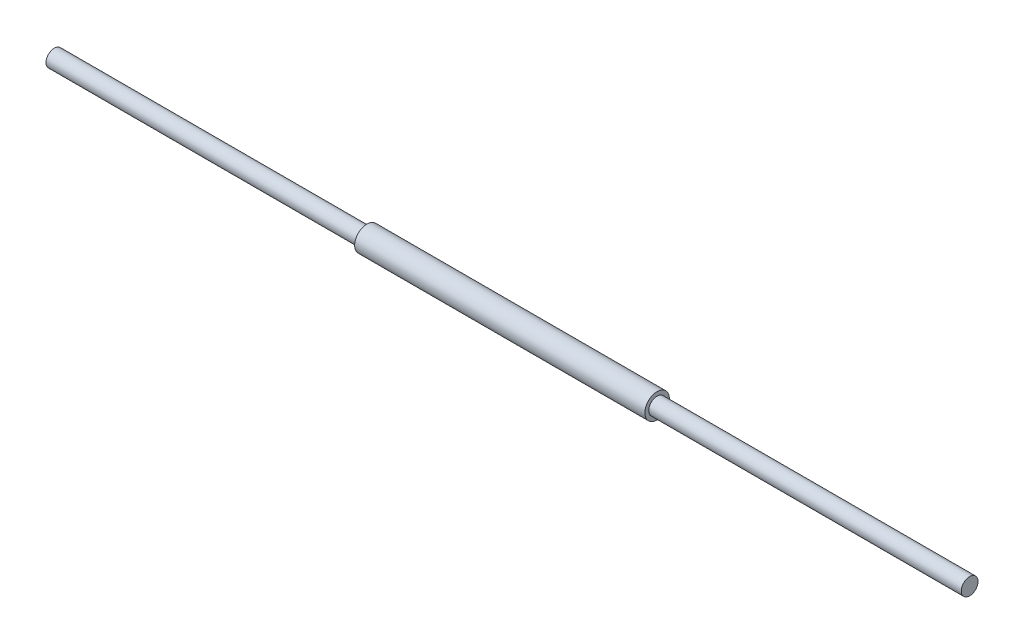
ISO-10303-21;
HEADER;
FILE_DESCRIPTION(('STEP AP214'),'2;1');
FILE_NAME('part.step','',(''),(''),'','','');
FILE_SCHEMA(('AUTOMOTIVE_DESIGN { 1 0 10303 214 1 1 1 1 }'));
ENDSEC;
DATA;
#1=APPLICATION_CONTEXT('core data for automotive mechanical design processes');
#2=APPLICATION_PROTOCOL_DEFINITION('international standard','automotive_design',2000,#1);
#3=PRODUCT_CONTEXT('',#1,'mechanical');
#4=PRODUCT('Part','Part','',(#3));
#5=PRODUCT_RELATED_PRODUCT_CATEGORY('part','',(#4));
#6=PRODUCT_DEFINITION_FORMATION('','',#4);
#7=PRODUCT_DEFINITION_CONTEXT('part definition',#1,'design');
#8=PRODUCT_DEFINITION('design','',#6,#7);
#9=PRODUCT_DEFINITION_SHAPE('','',#8);
#10=(LENGTH_UNIT() NAMED_UNIT(*) SI_UNIT(.MILLI.,.METRE.));
#11=(NAMED_UNIT(*) PLANE_ANGLE_UNIT() SI_UNIT($,.RADIAN.));
#12=(NAMED_UNIT(*) SI_UNIT($,.STERADIAN.) SOLID_ANGLE_UNIT());
#13=UNCERTAINTY_MEASURE_WITH_UNIT(LENGTH_MEASURE(1.E-05),#10,'distance_accuracy_value','');
#14=(GEOMETRIC_REPRESENTATION_CONTEXT(3) GLOBAL_UNCERTAINTY_ASSIGNED_CONTEXT((#13)) GLOBAL_UNIT_ASSIGNED_CONTEXT((#10,
#11,#12)) REPRESENTATION_CONTEXT('',''));
#15=CARTESIAN_POINT('',(0.,0.,0.));
#16=DIRECTION('',(0.,0.,1.));
#17=DIRECTION('',(1.,0.,0.));
#18=AXIS2_PLACEMENT_3D('',#15,#16,#17);
#19=CARTESIAN_POINT('',(-82.5499999999995,0.,0.));
#20=DIRECTION('',(-1.,0.,0.));
#21=DIRECTION('',(0.,0.,1.));
#22=AXIS2_PLACEMENT_3D('',#19,#20,#21);
#23=PLANE('',#22);
#24=CARTESIAN_POINT('',(-82.5499999999995,0.,0.));
#25=DIRECTION('',(-1.,0.,0.));
#26=DIRECTION('',(0.,0.,1.));
#27=AXIS2_PLACEMENT_3D('',#24,#25,#26);
#28=CIRCLE('',#27,6.98500000000001);
#29=CARTESIAN_POINT('',(-82.5499999999995,0.,6.98500000000001));
#30=VERTEX_POINT('',#29);
#31=EDGE_CURVE('E70',#30,#30,#28,.T.);
#32=ORIENTED_EDGE('',*,*,#31,.T.);
#33=EDGE_LOOP('',(#32));
#34=FACE_BOUND('',#33,.T.);
#35=CARTESIAN_POINT('',(-82.5499999999995,0.,0.));
#36=DIRECTION('',(-1.,0.,0.));
#37=DIRECTION('',(0.,0.,1.));
#38=AXIS2_PLACEMENT_3D('',#35,#36,#37);
#39=CIRCLE('',#38,4.76249999999992);
#40=CARTESIAN_POINT('',(-82.5499999999995,0.,4.76249999999992));
#41=VERTEX_POINT('',#40);
#42=EDGE_CURVE('E10',#41,#41,#39,.T.);
#43=ORIENTED_EDGE('',*,*,#42,.F.);
#44=EDGE_LOOP('',(#43));
#45=FACE_BOUND('',#44,.T.);
#46=ADVANCED_FACE('F43',(#34,#45),#23,.T.);
#47=CARTESIAN_POINT('',(-260.35,0.,0.));
#48=DIRECTION('',(-1.,0.,0.));
#49=DIRECTION('',(0.,0.,1.));
#50=AXIS2_PLACEMENT_3D('',#47,#48,#49);
#51=CYLINDRICAL_SURFACE('',#50,4.76249999999996);
#52=ORIENTED_EDGE('',*,*,#42,.T.);
#53=EDGE_LOOP('',(#52));
#54=FACE_BOUND('',#53,.T.);
#55=CARTESIAN_POINT('',(-260.35,0.,0.));
#56=DIRECTION('',(-1.,0.,0.));
#57=DIRECTION('',(0.,0.,1.));
#58=AXIS2_PLACEMENT_3D('',#55,#56,#57);
#59=CIRCLE('',#58,4.7625);
#60=CARTESIAN_POINT('',(-260.35,0.,4.7625));
#61=VERTEX_POINT('',#60);
#62=EDGE_CURVE('E50',#61,#61,#59,.T.);
#63=ORIENTED_EDGE('',*,*,#62,.F.);
#64=EDGE_LOOP('',(#63));
#65=FACE_BOUND('',#64,.T.);
#66=ADVANCED_FACE('F89',(#54,#65),#51,.T.);
#67=CARTESIAN_POINT('',(-260.35,0.,0.));
#68=DIRECTION('',(-1.,0.,0.));
#69=DIRECTION('',(0.,0.,1.));
#70=AXIS2_PLACEMENT_3D('',#67,#68,#69);
#71=PLANE('',#70);
#72=ORIENTED_EDGE('',*,*,#62,.T.);
#73=EDGE_LOOP('',(#72));
#74=FACE_BOUND('',#73,.T.);
#75=ADVANCED_FACE('F93',(#74),#71,.T.);
#76=CARTESIAN_POINT('',(260.35,0.,0.));
#77=DIRECTION('',(-1.,0.,0.));
#78=DIRECTION('',(0.,0.,1.));
#79=AXIS2_PLACEMENT_3D('',#76,#77,#78);
#80=PLANE('',#79);
#81=CARTESIAN_POINT('',(260.35,0.,0.));
#82=DIRECTION('',(-1.,0.,0.));
#83=DIRECTION('',(0.,0.,1.));
#84=AXIS2_PLACEMENT_3D('',#81,#82,#83);
#85=CIRCLE('',#84,4.7625);
#86=CARTESIAN_POINT('',(260.35,0.,4.7625));
#87=VERTEX_POINT('',#86);
#88=EDGE_CURVE('E55',#87,#87,#85,.T.);
#89=ORIENTED_EDGE('',*,*,#88,.F.);
#90=EDGE_LOOP('',(#89));
#91=FACE_BOUND('',#90,.T.);
#92=ADVANCED_FACE('F97',(#91),#80,.F.);
#93=CARTESIAN_POINT('',(-260.35,0.,0.));
#94=DIRECTION('',(-1.,0.,0.));
#95=DIRECTION('',(0.,0.,1.));
#96=AXIS2_PLACEMENT_3D('',#93,#94,#95);
#97=CYLINDRICAL_SURFACE('',#96,4.7625);
#98=ORIENTED_EDGE('',*,*,#88,.T.);
#99=EDGE_LOOP('',(#98));
#100=FACE_BOUND('',#99,.T.);
#101=CARTESIAN_POINT('',(82.5500000000005,0.,0.));
#102=DIRECTION('',(-1.,0.,0.));
#103=DIRECTION('',(0.,0.,1.));
#104=AXIS2_PLACEMENT_3D('',#101,#102,#103);
#105=CIRCLE('',#104,4.7625);
#106=CARTESIAN_POINT('',(82.5500000000005,0.,4.7625));
#107=VERTEX_POINT('',#106);
#108=EDGE_CURVE('E60',#107,#107,#105,.T.);
#109=ORIENTED_EDGE('',*,*,#108,.F.);
#110=EDGE_LOOP('',(#109));
#111=FACE_BOUND('',#110,.T.);
#112=ADVANCED_FACE('F85',(#100,#111),#97,.T.);
#113=CARTESIAN_POINT('',(82.5500000000005,0.,5.15460690004538E-13));
#114=DIRECTION('',(-1.,0.,0.));
#115=DIRECTION('',(0.,0.,1.));
#116=AXIS2_PLACEMENT_3D('',#113,#114,#115);
#117=PLANE('',#116);
#118=CARTESIAN_POINT('',(82.5500000000005,0.,0.));
#119=DIRECTION('',(-1.,0.,0.));
#120=DIRECTION('',(0.,0.,1.));
#121=AXIS2_PLACEMENT_3D('',#118,#119,#120);
#122=CIRCLE('',#121,6.98500000000001);
#123=CARTESIAN_POINT('',(82.5500000000005,0.,6.98500000000001));
#124=VERTEX_POINT('',#123);
#125=EDGE_CURVE('E66',#124,#124,#122,.T.);
#126=ORIENTED_EDGE('',*,*,#125,.F.);
#127=EDGE_LOOP('',(#126));
#128=FACE_BOUND('',#127,.T.);
#129=ORIENTED_EDGE('',*,*,#108,.T.);
#130=EDGE_LOOP('',(#129));
#131=FACE_BOUND('',#130,.T.);
#132=ADVANCED_FACE('F79',(#128,#131),#117,.F.);
#133=CARTESIAN_POINT('',(-260.35,0.,0.));
#134=DIRECTION('',(-1.,0.,0.));
#135=DIRECTION('',(0.,0.,1.));
#136=AXIS2_PLACEMENT_3D('',#133,#134,#135);
#137=CYLINDRICAL_SURFACE('',#136,6.98500000000001);
#138=ORIENTED_EDGE('',*,*,#125,.T.);
#139=EDGE_LOOP('',(#138));
#140=FACE_BOUND('',#139,.T.);
#141=ORIENTED_EDGE('',*,*,#31,.F.);
#142=EDGE_LOOP('',(#141));
#143=FACE_BOUND('',#142,.T.);
#144=ADVANCED_FACE('F77',(#140,#143),#137,.T.);
#145=CLOSED_SHELL('',(#46,#66,#75,#92,#112,#132,#144));
#146=MANIFOLD_SOLID_BREP('B2',#145);
#147=ADVANCED_BREP_SHAPE_REPRESENTATION('',(#18,#146),#14);
#148=SHAPE_DEFINITION_REPRESENTATION(#9,#147);
ENDSEC;
END-ISO-10303-21;
